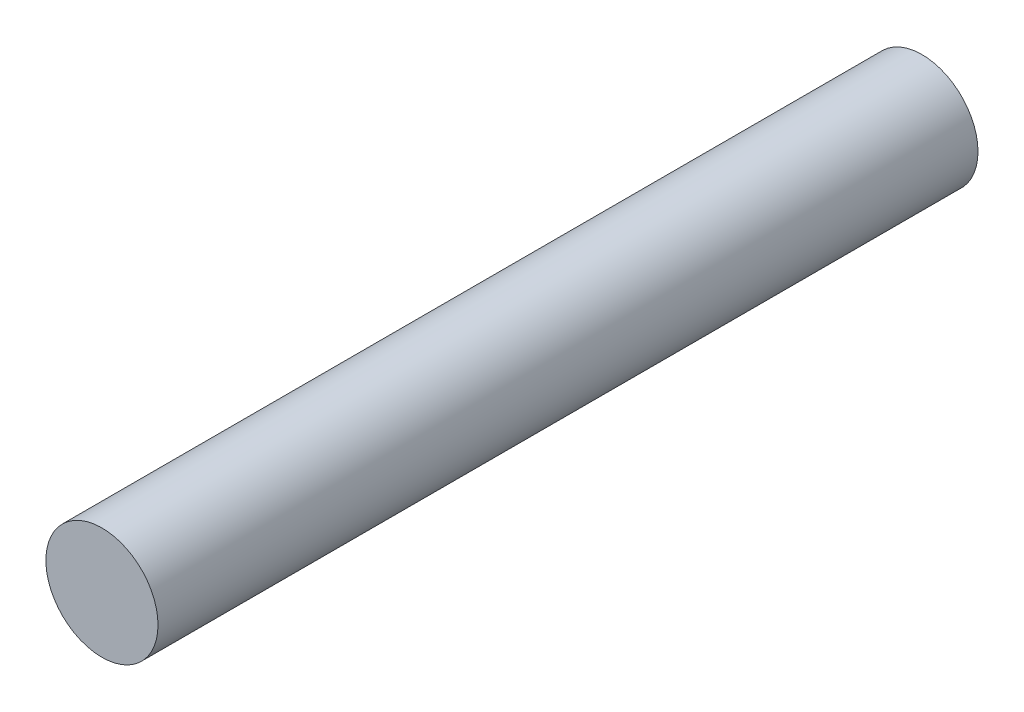
ISO-10303-21;
HEADER;
FILE_DESCRIPTION(('STEP AP214'),'2;1');
FILE_NAME('part.step','',(''),(''),'','','');
FILE_SCHEMA(('AUTOMOTIVE_DESIGN { 1 0 10303 214 1 1 1 1 }'));
ENDSEC;
DATA;
#1=APPLICATION_CONTEXT('core data for automotive mechanical design processes');
#2=APPLICATION_PROTOCOL_DEFINITION('international standard','automotive_design',2000,#1);
#3=PRODUCT_CONTEXT('',#1,'mechanical');
#4=PRODUCT('Part','Part','',(#3));
#5=PRODUCT_RELATED_PRODUCT_CATEGORY('part','',(#4));
#6=PRODUCT_DEFINITION_FORMATION('','',#4);
#7=PRODUCT_DEFINITION_CONTEXT('part definition',#1,'design');
#8=PRODUCT_DEFINITION('design','',#6,#7);
#9=PRODUCT_DEFINITION_SHAPE('','',#8);
#10=(LENGTH_UNIT() NAMED_UNIT(*) SI_UNIT(.MILLI.,.METRE.));
#11=(NAMED_UNIT(*) PLANE_ANGLE_UNIT() SI_UNIT($,.RADIAN.));
#12=(NAMED_UNIT(*) SI_UNIT($,.STERADIAN.) SOLID_ANGLE_UNIT());
#13=UNCERTAINTY_MEASURE_WITH_UNIT(LENGTH_MEASURE(1.E-05),#10,'distance_accuracy_value','');
#14=(GEOMETRIC_REPRESENTATION_CONTEXT(3) GLOBAL_UNCERTAINTY_ASSIGNED_CONTEXT((#13)) GLOBAL_UNIT_ASSIGNED_CONTEXT((#10,
#11,#12)) REPRESENTATION_CONTEXT('',''));
#15=CARTESIAN_POINT('',(0.,0.,0.));
#16=DIRECTION('',(0.,0.,1.));
#17=DIRECTION('',(1.,0.,0.));
#18=AXIS2_PLACEMENT_3D('',#15,#16,#17);
#19=CARTESIAN_POINT('',(0.,0.,17.4625));
#20=DIRECTION('',(0.,0.,-1.));
#21=DIRECTION('',(-1.,0.,0.));
#22=AXIS2_PLACEMENT_3D('',#19,#20,#21);
#23=CYLINDRICAL_SURFACE('',#22,2.3876);
#24=CARTESIAN_POINT('',(0.,0.,17.4625));
#25=DIRECTION('',(0.,0.,1.));
#26=DIRECTION('',(1.,0.,0.));
#27=AXIS2_PLACEMENT_3D('',#24,#25,#26);
#28=CIRCLE('',#27,2.3876);
#29=CARTESIAN_POINT('',(2.38760000000001,0.,17.4625));
#30=VERTEX_POINT('',#29);
#31=EDGE_CURVE('E12',#30,#30,#28,.T.);
#32=ORIENTED_EDGE('',*,*,#31,.F.);
#33=EDGE_LOOP('',(#32));
#34=FACE_BOUND('',#33,.T.);
#35=CARTESIAN_POINT('',(0.,0.,-17.4625));
#36=DIRECTION('',(0.,0.,1.));
#37=DIRECTION('',(1.,0.,0.));
#38=AXIS2_PLACEMENT_3D('',#35,#36,#37);
#39=CIRCLE('',#38,2.3876);
#40=CARTESIAN_POINT('',(2.38759999999999,0.,-17.4625));
#41=VERTEX_POINT('',#40);
#42=EDGE_CURVE('E50',#41,#41,#39,.T.);
#43=ORIENTED_EDGE('',*,*,#42,.T.);
#44=EDGE_LOOP('',(#43));
#45=FACE_BOUND('',#44,.T.);
#46=ADVANCED_FACE('F44',(#34,#45),#23,.T.);
#47=CARTESIAN_POINT('',(0.,0.,17.4625));
#48=DIRECTION('',(0.,0.,1.));
#49=DIRECTION('',(1.,0.,0.));
#50=AXIS2_PLACEMENT_3D('',#47,#48,#49);
#51=PLANE('',#50);
#52=ORIENTED_EDGE('',*,*,#31,.T.);
#53=EDGE_LOOP('',(#52));
#54=FACE_BOUND('',#53,.T.);
#55=ADVANCED_FACE('F59',(#54),#51,.T.);
#56=CARTESIAN_POINT('',(0.,0.,-17.4625));
#57=DIRECTION('',(0.,0.,1.));
#58=DIRECTION('',(1.,0.,0.));
#59=AXIS2_PLACEMENT_3D('',#56,#57,#58);
#60=PLANE('',#59);
#61=ORIENTED_EDGE('',*,*,#42,.F.);
#62=EDGE_LOOP('',(#61));
#63=FACE_BOUND('',#62,.T.);
#64=ADVANCED_FACE('F57',(#63),#60,.F.);
#65=CLOSED_SHELL('',(#46,#55,#64));
#66=MANIFOLD_SOLID_BREP('B2',#65);
#67=ADVANCED_BREP_SHAPE_REPRESENTATION('',(#18,#66),#14);
#68=SHAPE_DEFINITION_REPRESENTATION(#9,#67);
ENDSEC;
END-ISO-10303-21;
